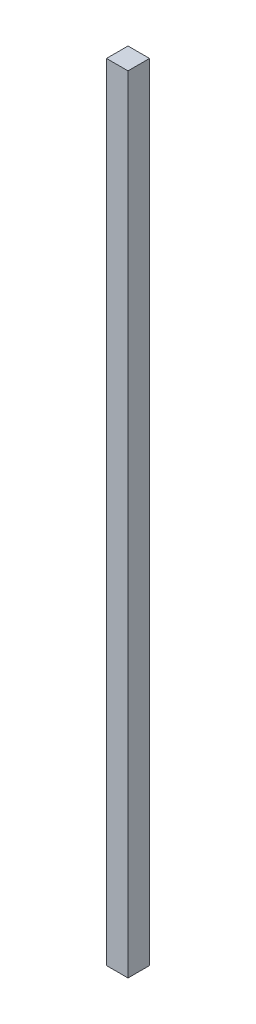
ISO-10303-21;
HEADER;
FILE_DESCRIPTION(('STEP AP214'),'2;1');
FILE_NAME('part.step','',(''),(''),'','','');
FILE_SCHEMA(('AUTOMOTIVE_DESIGN { 1 0 10303 214 1 1 1 1 }'));
ENDSEC;
DATA;
#1=APPLICATION_CONTEXT('core data for automotive mechanical design processes');
#2=APPLICATION_PROTOCOL_DEFINITION('international standard','automotive_design',2000,#1);
#3=PRODUCT_CONTEXT('',#1,'mechanical');
#4=PRODUCT('Part','Part','',(#3));
#5=PRODUCT_RELATED_PRODUCT_CATEGORY('part','',(#4));
#6=PRODUCT_DEFINITION_FORMATION('','',#4);
#7=PRODUCT_DEFINITION_CONTEXT('part definition',#1,'design');
#8=PRODUCT_DEFINITION('design','',#6,#7);
#9=PRODUCT_DEFINITION_SHAPE('','',#8);
#10=(LENGTH_UNIT() NAMED_UNIT(*) SI_UNIT(.MILLI.,.METRE.));
#11=(NAMED_UNIT(*) PLANE_ANGLE_UNIT() SI_UNIT($,.RADIAN.));
#12=(NAMED_UNIT(*) SI_UNIT($,.STERADIAN.) SOLID_ANGLE_UNIT());
#13=UNCERTAINTY_MEASURE_WITH_UNIT(LENGTH_MEASURE(1.E-05),#10,'distance_accuracy_value','');
#14=(GEOMETRIC_REPRESENTATION_CONTEXT(3) GLOBAL_UNCERTAINTY_ASSIGNED_CONTEXT((#13)) GLOBAL_UNIT_ASSIGNED_CONTEXT((#10,
#11,#12)) REPRESENTATION_CONTEXT('',''));
#15=CARTESIAN_POINT('',(0.,0.,0.));
#16=DIRECTION('',(0.,0.,1.));
#17=DIRECTION('',(1.,0.,0.));
#18=AXIS2_PLACEMENT_3D('',#15,#16,#17);
#19=CARTESIAN_POINT('',(-39.8355089835924,927.1,-18.6136158048334));
#20=DIRECTION('',(1.,0.,0.));
#21=DIRECTION('',(0.,0.,-1.));
#22=AXIS2_PLACEMENT_3D('',#19,#20,#21);
#23=PLANE('',#22);
#24=DIRECTION('',(0.,0.,1.));
#25=VECTOR('',#24,1.);
#26=CARTESIAN_POINT('',(-39.8355089835924,0.,-18.6136158048334));
#27=LINE('',#26,#25);
#28=CARTESIAN_POINT('',(-39.8355089835924,0.,-18.6136158048334));
#29=VERTEX_POINT('',#28);
#30=CARTESIAN_POINT('',(-39.8355089835924,0.,6.78638419516663));
#31=VERTEX_POINT('',#30);
#32=EDGE_CURVE('E94',#29,#31,#27,.T.);
#33=ORIENTED_EDGE('',*,*,#32,.T.);
#34=DIRECTION('',(0.,-1.,0.));
#35=VECTOR('',#34,1.);
#36=CARTESIAN_POINT('',(-39.8355089835924,927.1,6.78638419516663));
#37=LINE('',#36,#35);
#38=CARTESIAN_POINT('',(-39.8355089835924,927.1,6.78638419516663));
#39=VERTEX_POINT('',#38);
#40=EDGE_CURVE('E11',#39,#31,#37,.T.);
#41=ORIENTED_EDGE('',*,*,#40,.F.);
#42=DIRECTION('',(0.,0.,1.));
#43=VECTOR('',#42,1.);
#44=CARTESIAN_POINT('',(-39.8355089835924,927.1,-18.6136158048334));
#45=LINE('',#44,#43);
#46=CARTESIAN_POINT('',(-39.8355089835924,927.1,-18.6136158048334));
#47=VERTEX_POINT('',#46);
#48=EDGE_CURVE('E82',#47,#39,#45,.T.);
#49=ORIENTED_EDGE('',*,*,#48,.F.);
#50=DIRECTION('',(0.,-1.,0.));
#51=VECTOR('',#50,1.);
#52=CARTESIAN_POINT('',(-39.8355089835924,927.1,-18.6136158048334));
#53=LINE('',#52,#51);
#54=EDGE_CURVE('E90',#47,#29,#53,.T.);
#55=ORIENTED_EDGE('',*,*,#54,.T.);
#56=EDGE_LOOP('',(#33,#41,#49,#55));
#57=FACE_BOUND('',#56,.T.);
#58=ADVANCED_FACE('F31',(#57),#23,.F.);
#59=CARTESIAN_POINT('',(-39.8355089835924,927.1,6.78638419516663));
#60=DIRECTION('',(0.,0.,-1.));
#61=DIRECTION('',(-1.,0.,0.));
#62=AXIS2_PLACEMENT_3D('',#59,#60,#61);
#63=PLANE('',#62);
#64=DIRECTION('',(1.,0.,0.));
#65=VECTOR('',#64,1.);
#66=CARTESIAN_POINT('',(-39.8355089835924,0.,6.78638419516663));
#67=LINE('',#66,#65);
#68=CARTESIAN_POINT('',(-14.4355089835924,0.,6.78638419516663));
#69=VERTEX_POINT('',#68);
#70=EDGE_CURVE('E86',#31,#69,#67,.T.);
#71=ORIENTED_EDGE('',*,*,#70,.T.);
#72=DIRECTION('',(0.,-1.,0.));
#73=VECTOR('',#72,1.);
#74=CARTESIAN_POINT('',(-14.4355089835924,927.1,6.78638419516663));
#75=LINE('',#74,#73);
#76=CARTESIAN_POINT('',(-14.4355089835924,927.1,6.78638419516663));
#77=VERTEX_POINT('',#76);
#78=EDGE_CURVE('E39',#77,#69,#75,.T.);
#79=ORIENTED_EDGE('',*,*,#78,.F.);
#80=DIRECTION('',(1.,0.,0.));
#81=VECTOR('',#80,1.);
#82=CARTESIAN_POINT('',(-39.8355089835924,927.1,6.78638419516663));
#83=LINE('',#82,#81);
#84=EDGE_CURVE('E77',#39,#77,#83,.T.);
#85=ORIENTED_EDGE('',*,*,#84,.F.);
#86=ORIENTED_EDGE('',*,*,#40,.T.);
#87=EDGE_LOOP('',(#71,#79,#85,#86));
#88=FACE_BOUND('',#87,.T.);
#89=ADVANCED_FACE('F85',(#88),#63,.F.);
#90=CARTESIAN_POINT('',(-14.4355089835924,927.1,-18.6136158048334));
#91=DIRECTION('',(-1.,0.,0.));
#92=DIRECTION('',(0.,0.,1.));
#93=AXIS2_PLACEMENT_3D('',#90,#91,#92);
#94=PLANE('',#93);
#95=DIRECTION('',(0.,0.,-1.));
#96=VECTOR('',#95,1.);
#97=CARTESIAN_POINT('',(-14.4355089835924,0.,-18.6136158048334));
#98=LINE('',#97,#96);
#99=CARTESIAN_POINT('',(-14.4355089835924,0.,-18.6136158048334));
#100=VERTEX_POINT('',#99);
#101=EDGE_CURVE('E64',#69,#100,#98,.T.);
#102=ORIENTED_EDGE('',*,*,#101,.T.);
#103=DIRECTION('',(0.,-1.,0.));
#104=VECTOR('',#103,1.);
#105=CARTESIAN_POINT('',(-14.4355089835924,927.1,-18.6136158048334));
#106=LINE('',#105,#104);
#107=CARTESIAN_POINT('',(-14.4355089835924,927.1,-18.6136158048334));
#108=VERTEX_POINT('',#107);
#109=EDGE_CURVE('E87',#108,#100,#106,.T.);
#110=ORIENTED_EDGE('',*,*,#109,.F.);
#111=DIRECTION('',(0.,0.,-1.));
#112=VECTOR('',#111,1.);
#113=CARTESIAN_POINT('',(-14.4355089835924,927.1,-18.6136158048334));
#114=LINE('',#113,#112);
#115=EDGE_CURVE('E80',#77,#108,#114,.T.);
#116=ORIENTED_EDGE('',*,*,#115,.F.);
#117=ORIENTED_EDGE('',*,*,#78,.T.);
#118=EDGE_LOOP('',(#102,#110,#116,#117));
#119=FACE_BOUND('',#118,.T.);
#120=ADVANCED_FACE('F88',(#119),#94,.F.);
#121=CARTESIAN_POINT('',(-39.8355089835924,927.1,-18.6136158048334));
#122=DIRECTION('',(0.,0.,1.));
#123=DIRECTION('',(1.,0.,0.));
#124=AXIS2_PLACEMENT_3D('',#121,#122,#123);
#125=PLANE('',#124);
#126=DIRECTION('',(-1.,0.,0.));
#127=VECTOR('',#126,1.);
#128=CARTESIAN_POINT('',(-39.8355089835924,0.,-18.6136158048334));
#129=LINE('',#128,#127);
#130=EDGE_CURVE('E70',#100,#29,#129,.T.);
#131=ORIENTED_EDGE('',*,*,#130,.T.);
#132=ORIENTED_EDGE('',*,*,#54,.F.);
#133=DIRECTION('',(-1.,0.,0.));
#134=VECTOR('',#133,1.);
#135=CARTESIAN_POINT('',(-39.8355089835924,927.1,-18.6136158048334));
#136=LINE('',#135,#134);
#137=EDGE_CURVE('E47',#108,#47,#136,.T.);
#138=ORIENTED_EDGE('',*,*,#137,.F.);
#139=ORIENTED_EDGE('',*,*,#109,.T.);
#140=EDGE_LOOP('',(#131,#132,#138,#139));
#141=FACE_BOUND('',#140,.T.);
#142=ADVANCED_FACE('F101',(#141),#125,.F.);
#143=CARTESIAN_POINT('',(-39.8355089835924,927.1,6.78638419516663));
#144=DIRECTION('',(0.,1.,0.));
#145=DIRECTION('',(0.,0.,1.));
#146=AXIS2_PLACEMENT_3D('',#143,#144,#145);
#147=PLANE('',#146);
#148=ORIENTED_EDGE('',*,*,#48,.T.);
#149=ORIENTED_EDGE('',*,*,#84,.T.);
#150=ORIENTED_EDGE('',*,*,#115,.T.);
#151=ORIENTED_EDGE('',*,*,#137,.T.);
#152=EDGE_LOOP('',(#148,#149,#150,#151));
#153=FACE_BOUND('',#152,.T.);
#154=ADVANCED_FACE('F78',(#153),#147,.T.);
#155=CARTESIAN_POINT('',(-39.8355089835924,0.,6.78638419516663));
#156=DIRECTION('',(0.,1.,0.));
#157=DIRECTION('',(0.,0.,1.));
#158=AXIS2_PLACEMENT_3D('',#155,#156,#157);
#159=PLANE('',#158);
#160=ORIENTED_EDGE('',*,*,#32,.F.);
#161=ORIENTED_EDGE('',*,*,#130,.F.);
#162=ORIENTED_EDGE('',*,*,#101,.F.);
#163=ORIENTED_EDGE('',*,*,#70,.F.);
#164=EDGE_LOOP('',(#160,#161,#162,#163));
#165=FACE_BOUND('',#164,.T.);
#166=ADVANCED_FACE('F104',(#165),#159,.F.);
#167=CLOSED_SHELL('',(#58,#89,#120,#142,#154,#166));
#168=MANIFOLD_SOLID_BREP('B2',#167);
#169=ADVANCED_BREP_SHAPE_REPRESENTATION('',(#18,#168),#14);
#170=SHAPE_DEFINITION_REPRESENTATION(#9,#169);
ENDSEC;
END-ISO-10303-21;
